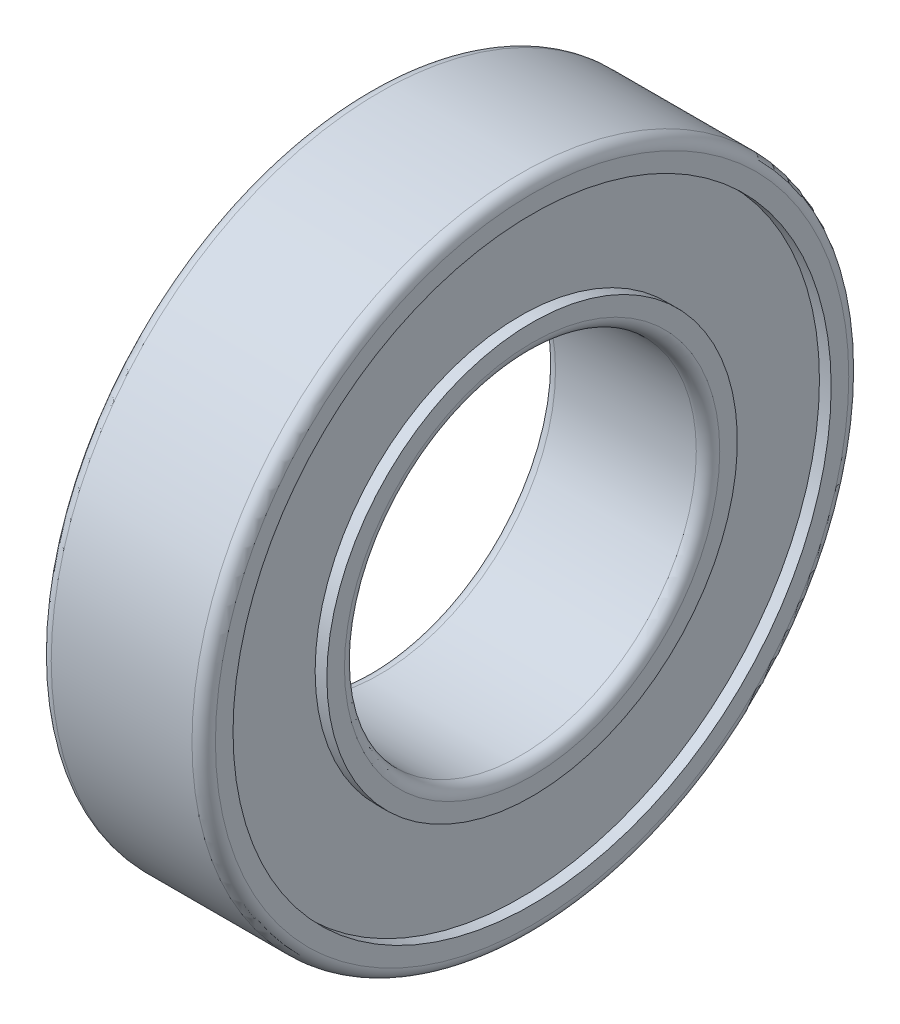
ISO-10303-21;
HEADER;
FILE_DESCRIPTION(('STEP AP214'),'2;1');
FILE_NAME('part.step','',(''),(''),'','','');
FILE_SCHEMA(('AUTOMOTIVE_DESIGN { 1 0 10303 214 1 1 1 1 }'));
ENDSEC;
DATA;
#1=APPLICATION_CONTEXT('core data for automotive mechanical design processes');
#2=APPLICATION_PROTOCOL_DEFINITION('international standard','automotive_design',2000,#1);
#3=PRODUCT_CONTEXT('',#1,'mechanical');
#4=PRODUCT('Part','Part','',(#3));
#5=PRODUCT_RELATED_PRODUCT_CATEGORY('part','',(#4));
#6=PRODUCT_DEFINITION_FORMATION('','',#4);
#7=PRODUCT_DEFINITION_CONTEXT('part definition',#1,'design');
#8=PRODUCT_DEFINITION('design','',#6,#7);
#9=PRODUCT_DEFINITION_SHAPE('','',#8);
#10=(LENGTH_UNIT() NAMED_UNIT(*) SI_UNIT(.MILLI.,.METRE.));
#11=(NAMED_UNIT(*) PLANE_ANGLE_UNIT() SI_UNIT($,.RADIAN.));
#12=(NAMED_UNIT(*) SI_UNIT($,.STERADIAN.) SOLID_ANGLE_UNIT());
#13=UNCERTAINTY_MEASURE_WITH_UNIT(LENGTH_MEASURE(1.E-05),#10,'distance_accuracy_value','');
#14=(GEOMETRIC_REPRESENTATION_CONTEXT(3) GLOBAL_UNCERTAINTY_ASSIGNED_CONTEXT((#13)) GLOBAL_UNIT_ASSIGNED_CONTEXT((#10,
#11,#12)) REPRESENTATION_CONTEXT('',''));
#15=CARTESIAN_POINT('',(0.,0.,0.));
#16=DIRECTION('',(0.,0.,1.));
#17=DIRECTION('',(1.,0.,0.));
#18=AXIS2_PLACEMENT_3D('',#15,#16,#17);
#19=CARTESIAN_POINT('',(0.5,12.75,0.));
#20=DIRECTION('',(1.,0.,0.));
#21=DIRECTION('',(0.,0.,-1.));
#22=AXIS2_PLACEMENT_3D('',#19,#20,#21);
#23=PLANE('',#22);
#24=CARTESIAN_POINT('',(0.5,0.,0.));
#25=DIRECTION('',(-1.,0.,0.));
#26=DIRECTION('',(0.,0.,1.));
#27=AXIS2_PLACEMENT_3D('',#24,#25,#26);
#28=CIRCLE('',#27,12.75);
#29=CARTESIAN_POINT('',(0.5,0.,12.75));
#30=VERTEX_POINT('',#29);
#31=EDGE_CURVE('E297',#30,#30,#28,.T.);
#32=ORIENTED_EDGE('',*,*,#31,.T.);
#33=EDGE_LOOP('',(#32));
#34=FACE_BOUND('',#33,.T.);
#35=CARTESIAN_POINT('',(0.5,0.,0.));
#36=DIRECTION('',(-1.,0.,0.));
#37=DIRECTION('',(0.,0.,1.));
#38=AXIS2_PLACEMENT_3D('',#35,#36,#37);
#39=CIRCLE('',#38,8.75);
#40=CARTESIAN_POINT('',(0.5,0.,8.75));
#41=VERTEX_POINT('',#40);
#42=EDGE_CURVE('E295',#41,#41,#39,.T.);
#43=ORIENTED_EDGE('',*,*,#42,.F.);
#44=EDGE_LOOP('',(#43));
#45=FACE_BOUND('',#44,.T.);
#46=ADVANCED_FACE('F16',(#34,#45),#23,.F.);
#47=CARTESIAN_POINT('',(0.,0.,0.));
#48=DIRECTION('',(-1.,0.,0.));
#49=DIRECTION('',(0.,0.,1.));
#50=AXIS2_PLACEMENT_3D('',#47,#48,#49);
#51=CYLINDRICAL_SURFACE('',#50,12.75);
#52=ORIENTED_EDGE('',*,*,#31,.F.);
#53=EDGE_LOOP('',(#52));
#54=FACE_BOUND('',#53,.T.);
#55=CARTESIAN_POINT('',(0.,0.,0.));
#56=DIRECTION('',(-1.,0.,0.));
#57=DIRECTION('',(0.,0.,1.));
#58=AXIS2_PLACEMENT_3D('',#55,#56,#57);
#59=CIRCLE('',#58,12.75);
#60=CARTESIAN_POINT('',(0.,0.,12.75));
#61=VERTEX_POINT('',#60);
#62=EDGE_CURVE('E292',#61,#61,#59,.T.);
#63=ORIENTED_EDGE('',*,*,#62,.T.);
#64=EDGE_LOOP('',(#63));
#65=FACE_BOUND('',#64,.T.);
#66=ADVANCED_FACE('F101',(#54,#65),#51,.F.);
#67=CARTESIAN_POINT('',(0.,0.,0.));
#68=DIRECTION('',(-1.,0.,0.));
#69=DIRECTION('',(0.,0.,1.));
#70=AXIS2_PLACEMENT_3D('',#67,#68,#69);
#71=CYLINDRICAL_SURFACE('',#70,8.75);
#72=CARTESIAN_POINT('',(0.,0.,0.));
#73=DIRECTION('',(-1.,0.,0.));
#74=DIRECTION('',(0.,0.,1.));
#75=AXIS2_PLACEMENT_3D('',#72,#73,#74);
#76=CIRCLE('',#75,8.75);
#77=CARTESIAN_POINT('',(0.,0.,8.75));
#78=VERTEX_POINT('',#77);
#79=EDGE_CURVE('E69',#78,#78,#76,.F.);
#80=ORIENTED_EDGE('',*,*,#79,.T.);
#81=EDGE_LOOP('',(#80));
#82=FACE_BOUND('',#81,.T.);
#83=ORIENTED_EDGE('',*,*,#42,.T.);
#84=EDGE_LOOP('',(#83));
#85=FACE_BOUND('',#84,.T.);
#86=ADVANCED_FACE('F89',(#82,#85),#71,.T.);
#87=CARTESIAN_POINT('',(0.,14.,0.));
#88=DIRECTION('',(1.,0.,0.));
#89=DIRECTION('',(0.,0.,-1.));
#90=AXIS2_PLACEMENT_3D('',#87,#88,#89);
#91=PLANE('',#90);
#92=ORIENTED_EDGE('',*,*,#62,.F.);
#93=EDGE_LOOP('',(#92));
#94=FACE_BOUND('',#93,.T.);
#95=CARTESIAN_POINT('',(0.,0.,0.));
#96=DIRECTION('',(1.,0.,0.));
#97=DIRECTION('',(0.,0.,-1.));
#98=AXIS2_PLACEMENT_3D('',#95,#96,#97);
#99=CIRCLE('',#98,13.5);
#100=CARTESIAN_POINT('',(0.,0.,-13.5));
#101=VERTEX_POINT('',#100);
#102=CARTESIAN_POINT('',(0.,0.,13.5));
#103=VERTEX_POINT('',#102);
#104=EDGE_CURVE('E56',#101,#103,#99,.T.);
#105=ORIENTED_EDGE('',*,*,#104,.F.);
#106=CARTESIAN_POINT('',(0.,0.,0.));
#107=DIRECTION('',(1.,0.,0.));
#108=DIRECTION('',(0.,0.,1.));
#109=AXIS2_PLACEMENT_3D('',#106,#107,#108);
#110=CIRCLE('',#109,13.5);
#111=EDGE_CURVE('E58',#103,#101,#110,.T.);
#112=ORIENTED_EDGE('',*,*,#111,.F.);
#113=EDGE_LOOP('',(#105,#112));
#114=FACE_BOUND('',#113,.T.);
#115=ADVANCED_FACE('F68',(#94,#114),#91,.F.);
#116=CARTESIAN_POINT('',(0.,8.75,0.));
#117=DIRECTION('',(1.,0.,0.));
#118=DIRECTION('',(0.,0.,-1.));
#119=AXIS2_PLACEMENT_3D('',#116,#117,#118);
#120=PLANE('',#119);
#121=ORIENTED_EDGE('',*,*,#79,.F.);
#122=EDGE_LOOP('',(#121));
#123=FACE_BOUND('',#122,.T.);
#124=CARTESIAN_POINT('',(0.,0.,0.));
#125=DIRECTION('',(-1.,0.,0.));
#126=DIRECTION('',(0.,0.,-1.));
#127=AXIS2_PLACEMENT_3D('',#124,#125,#126);
#128=CIRCLE('',#127,8.);
#129=CARTESIAN_POINT('',(0.,0.,-8.));
#130=VERTEX_POINT('',#129);
#131=CARTESIAN_POINT('',(0.,0.,8.));
#132=VERTEX_POINT('',#131);
#133=EDGE_CURVE('E64',#130,#132,#128,.T.);
#134=ORIENTED_EDGE('',*,*,#133,.F.);
#135=CARTESIAN_POINT('',(0.,0.,0.));
#136=DIRECTION('',(-1.,0.,0.));
#137=DIRECTION('',(0.,0.,1.));
#138=AXIS2_PLACEMENT_3D('',#135,#136,#137);
#139=CIRCLE('',#138,8.);
#140=EDGE_CURVE('E239',#132,#130,#139,.T.);
#141=ORIENTED_EDGE('',*,*,#140,.F.);
#142=EDGE_LOOP('',(#134,#141));
#143=FACE_BOUND('',#142,.T.);
#144=ADVANCED_FACE('F88',(#123,#143),#120,.F.);
#145=CARTESIAN_POINT('',(0.500000000000002,0.,0.));
#146=DIRECTION('',(1.,0.,0.));
#147=DIRECTION('',(0.,0.,-1.));
#148=AXIS2_PLACEMENT_3D('',#145,#146,#147);
#149=TOROIDAL_SURFACE('',#148,13.5,0.5);
#150=ORIENTED_EDGE('',*,*,#104,.T.);
#151=ORIENTED_EDGE('',*,*,#111,.T.);
#152=EDGE_LOOP('',(#150,#151));
#153=FACE_BOUND('',#152,.T.);
#154=CARTESIAN_POINT('',(0.500000000000002,0.,0.));
#155=DIRECTION('',(-1.,0.,0.));
#156=DIRECTION('',(0.,0.,1.));
#157=AXIS2_PLACEMENT_3D('',#154,#155,#156);
#158=CIRCLE('',#157,14.);
#159=CARTESIAN_POINT('',(0.500000000000002,0.,14.));
#160=VERTEX_POINT('',#159);
#161=EDGE_CURVE('E236',#160,#160,#158,.F.);
#162=ORIENTED_EDGE('',*,*,#161,.F.);
#163=EDGE_LOOP('',(#162));
#164=FACE_BOUND('',#163,.T.);
#165=ADVANCED_FACE('F60',(#153,#164),#149,.T.);
#166=CARTESIAN_POINT('',(0.5,0.,0.));
#167=DIRECTION('',(1.,0.,0.));
#168=DIRECTION('',(0.,0.,-1.));
#169=AXIS2_PLACEMENT_3D('',#166,#167,#168);
#170=TOROIDAL_SURFACE('',#169,8.,0.5);
#171=ORIENTED_EDGE('',*,*,#133,.T.);
#172=ORIENTED_EDGE('',*,*,#140,.T.);
#173=EDGE_LOOP('',(#171,#172));
#174=FACE_BOUND('',#173,.T.);
#175=CARTESIAN_POINT('',(0.5,0.,0.));
#176=DIRECTION('',(-1.,0.,0.));
#177=DIRECTION('',(0.,0.,1.));
#178=AXIS2_PLACEMENT_3D('',#175,#176,#177);
#179=CIRCLE('',#178,7.5);
#180=CARTESIAN_POINT('',(0.5,0.,7.5));
#181=VERTEX_POINT('',#180);
#182=EDGE_CURVE('E232',#181,#181,#179,.F.);
#183=ORIENTED_EDGE('',*,*,#182,.T.);
#184=EDGE_LOOP('',(#183));
#185=FACE_BOUND('',#184,.T.);
#186=ADVANCED_FACE('F216',(#174,#185),#170,.T.);
#187=CARTESIAN_POINT('',(0.,0.,0.));
#188=DIRECTION('',(-1.,0.,0.));
#189=DIRECTION('',(0.,0.,1.));
#190=AXIS2_PLACEMENT_3D('',#187,#188,#189);
#191=CYLINDRICAL_SURFACE('',#190,14.);
#192=CARTESIAN_POINT('',(6.5,0.,0.));
#193=DIRECTION('',(-1.,0.,0.));
#194=DIRECTION('',(0.,0.,1.));
#195=AXIS2_PLACEMENT_3D('',#192,#193,#194);
#196=CIRCLE('',#195,14.);
#197=CARTESIAN_POINT('',(6.5,0.,14.));
#198=VERTEX_POINT('',#197);
#199=EDGE_CURVE('E262',#198,#198,#196,.F.);
#200=ORIENTED_EDGE('',*,*,#199,.F.);
#201=EDGE_LOOP('',(#200));
#202=FACE_BOUND('',#201,.T.);
#203=ORIENTED_EDGE('',*,*,#161,.T.);
#204=EDGE_LOOP('',(#203));
#205=FACE_BOUND('',#204,.T.);
#206=ADVANCED_FACE('F226',(#202,#205),#191,.T.);
#207=CARTESIAN_POINT('',(0.,0.,0.));
#208=DIRECTION('',(-1.,0.,0.));
#209=DIRECTION('',(0.,0.,1.));
#210=AXIS2_PLACEMENT_3D('',#207,#208,#209);
#211=CYLINDRICAL_SURFACE('',#210,7.5);
#212=CARTESIAN_POINT('',(6.5,0.,0.));
#213=DIRECTION('',(-1.,0.,0.));
#214=DIRECTION('',(0.,0.,1.));
#215=AXIS2_PLACEMENT_3D('',#212,#213,#214);
#216=CIRCLE('',#215,7.5);
#217=CARTESIAN_POINT('',(6.5,0.,7.5));
#218=VERTEX_POINT('',#217);
#219=EDGE_CURVE('E264',#218,#218,#216,.T.);
#220=ORIENTED_EDGE('',*,*,#219,.F.);
#221=EDGE_LOOP('',(#220));
#222=FACE_BOUND('',#221,.T.);
#223=ORIENTED_EDGE('',*,*,#182,.F.);
#224=EDGE_LOOP('',(#223));
#225=FACE_BOUND('',#224,.T.);
#226=ADVANCED_FACE('F323',(#222,#225),#211,.F.);
#227=CARTESIAN_POINT('',(6.5,0.,0.));
#228=DIRECTION('',(-1.,0.,0.));
#229=DIRECTION('',(0.,0.,1.));
#230=AXIS2_PLACEMENT_3D('',#227,#228,#229);
#231=TOROIDAL_SURFACE('',#230,13.5,0.5);
#232=CARTESIAN_POINT('',(7.,0.,0.));
#233=DIRECTION('',(-1.,0.,0.));
#234=DIRECTION('',(0.,0.,1.));
#235=AXIS2_PLACEMENT_3D('',#232,#233,#234);
#236=CIRCLE('',#235,13.5);
#237=CARTESIAN_POINT('',(7.,0.,13.5));
#238=VERTEX_POINT('',#237);
#239=CARTESIAN_POINT('',(7.,0.,-13.5));
#240=VERTEX_POINT('',#239);
#241=EDGE_CURVE('E154',#238,#240,#236,.T.);
#242=ORIENTED_EDGE('',*,*,#241,.T.);
#243=CARTESIAN_POINT('',(7.,0.,0.));
#244=DIRECTION('',(-1.,0.,0.));
#245=DIRECTION('',(0.,0.,-1.));
#246=AXIS2_PLACEMENT_3D('',#243,#244,#245);
#247=CIRCLE('',#246,13.5);
#248=EDGE_CURVE('E165',#240,#238,#247,.T.);
#249=ORIENTED_EDGE('',*,*,#248,.T.);
#250=EDGE_LOOP('',(#242,#249));
#251=FACE_BOUND('',#250,.T.);
#252=ORIENTED_EDGE('',*,*,#199,.T.);
#253=EDGE_LOOP('',(#252));
#254=FACE_BOUND('',#253,.T.);
#255=ADVANCED_FACE('F181',(#251,#254),#231,.T.);
#256=CARTESIAN_POINT('',(6.5,0.,0.));
#257=DIRECTION('',(-1.,0.,0.));
#258=DIRECTION('',(0.,0.,1.));
#259=AXIS2_PLACEMENT_3D('',#256,#257,#258);
#260=TOROIDAL_SURFACE('',#259,8.,0.5);
#261=CARTESIAN_POINT('',(7.,0.,0.));
#262=DIRECTION('',(1.,0.,0.));
#263=DIRECTION('',(0.,0.,1.));
#264=AXIS2_PLACEMENT_3D('',#261,#262,#263);
#265=CIRCLE('',#264,8.);
#266=CARTESIAN_POINT('',(7.,0.,8.));
#267=VERTEX_POINT('',#266);
#268=CARTESIAN_POINT('',(7.,0.,-8.));
#269=VERTEX_POINT('',#268);
#270=EDGE_CURVE('E279',#267,#269,#265,.T.);
#271=ORIENTED_EDGE('',*,*,#270,.T.);
#272=CARTESIAN_POINT('',(7.,0.,0.));
#273=DIRECTION('',(1.,0.,0.));
#274=DIRECTION('',(0.,0.,-1.));
#275=AXIS2_PLACEMENT_3D('',#272,#273,#274);
#276=CIRCLE('',#275,8.);
#277=EDGE_CURVE('E35',#269,#267,#276,.T.);
#278=ORIENTED_EDGE('',*,*,#277,.T.);
#279=EDGE_LOOP('',(#271,#278));
#280=FACE_BOUND('',#279,.T.);
#281=ORIENTED_EDGE('',*,*,#219,.T.);
#282=EDGE_LOOP('',(#281));
#283=FACE_BOUND('',#282,.T.);
#284=ADVANCED_FACE('F177',(#280,#283),#260,.T.);
#285=CARTESIAN_POINT('',(7.,12.75,0.));
#286=DIRECTION('',(-1.,0.,0.));
#287=DIRECTION('',(0.,0.,1.));
#288=AXIS2_PLACEMENT_3D('',#285,#286,#287);
#289=PLANE('',#288);
#290=CARTESIAN_POINT('',(7.,0.,0.));
#291=DIRECTION('',(-1.,0.,0.));
#292=DIRECTION('',(0.,0.,1.));
#293=AXIS2_PLACEMENT_3D('',#290,#291,#292);
#294=CIRCLE('',#293,12.75);
#295=CARTESIAN_POINT('',(7.,0.,12.75));
#296=VERTEX_POINT('',#295);
#297=EDGE_CURVE('E280',#296,#296,#294,.T.);
#298=ORIENTED_EDGE('',*,*,#297,.T.);
#299=EDGE_LOOP('',(#298));
#300=FACE_BOUND('',#299,.T.);
#301=ORIENTED_EDGE('',*,*,#241,.F.);
#302=ORIENTED_EDGE('',*,*,#248,.F.);
#303=EDGE_LOOP('',(#301,#302));
#304=FACE_BOUND('',#303,.T.);
#305=ADVANCED_FACE('F133',(#300,#304),#289,.F.);
#306=CARTESIAN_POINT('',(7.,7.5,0.));
#307=DIRECTION('',(-1.,0.,0.));
#308=DIRECTION('',(0.,0.,1.));
#309=AXIS2_PLACEMENT_3D('',#306,#307,#308);
#310=PLANE('',#309);
#311=CARTESIAN_POINT('',(7.,0.,0.));
#312=DIRECTION('',(-1.,0.,0.));
#313=DIRECTION('',(0.,0.,1.));
#314=AXIS2_PLACEMENT_3D('',#311,#312,#313);
#315=CIRCLE('',#314,8.75);
#316=CARTESIAN_POINT('',(7.,0.,8.75));
#317=VERTEX_POINT('',#316);
#318=EDGE_CURVE('E282',#317,#317,#315,.T.);
#319=ORIENTED_EDGE('',*,*,#318,.F.);
#320=EDGE_LOOP('',(#319));
#321=FACE_BOUND('',#320,.T.);
#322=ORIENTED_EDGE('',*,*,#270,.F.);
#323=ORIENTED_EDGE('',*,*,#277,.F.);
#324=EDGE_LOOP('',(#322,#323));
#325=FACE_BOUND('',#324,.T.);
#326=ADVANCED_FACE('F128',(#321,#325),#310,.F.);
#327=CARTESIAN_POINT('',(0.,0.,0.));
#328=DIRECTION('',(-1.,0.,0.));
#329=DIRECTION('',(0.,0.,1.));
#330=AXIS2_PLACEMENT_3D('',#327,#328,#329);
#331=CYLINDRICAL_SURFACE('',#330,12.75);
#332=ORIENTED_EDGE('',*,*,#297,.F.);
#333=EDGE_LOOP('',(#332));
#334=FACE_BOUND('',#333,.T.);
#335=CARTESIAN_POINT('',(6.5,0.,0.));
#336=DIRECTION('',(-1.,0.,0.));
#337=DIRECTION('',(0.,0.,1.));
#338=AXIS2_PLACEMENT_3D('',#335,#336,#337);
#339=CIRCLE('',#338,12.75);
#340=CARTESIAN_POINT('',(6.5,0.,12.75));
#341=VERTEX_POINT('',#340);
#342=EDGE_CURVE('E27',#341,#341,#339,.T.);
#343=ORIENTED_EDGE('',*,*,#342,.T.);
#344=EDGE_LOOP('',(#343));
#345=FACE_BOUND('',#344,.T.);
#346=ADVANCED_FACE('F120',(#334,#345),#331,.F.);
#347=CARTESIAN_POINT('',(0.,0.,0.));
#348=DIRECTION('',(-1.,0.,0.));
#349=DIRECTION('',(0.,0.,1.));
#350=AXIS2_PLACEMENT_3D('',#347,#348,#349);
#351=CYLINDRICAL_SURFACE('',#350,8.75);
#352=CARTESIAN_POINT('',(6.5,0.,0.));
#353=DIRECTION('',(-1.,0.,0.));
#354=DIRECTION('',(0.,0.,1.));
#355=AXIS2_PLACEMENT_3D('',#352,#353,#354);
#356=CIRCLE('',#355,8.75);
#357=CARTESIAN_POINT('',(6.5,0.,8.75));
#358=VERTEX_POINT('',#357);
#359=EDGE_CURVE('E10',#358,#358,#356,.F.);
#360=ORIENTED_EDGE('',*,*,#359,.T.);
#361=EDGE_LOOP('',(#360));
#362=FACE_BOUND('',#361,.T.);
#363=ORIENTED_EDGE('',*,*,#318,.T.);
#364=EDGE_LOOP('',(#363));
#365=FACE_BOUND('',#364,.T.);
#366=ADVANCED_FACE('F114',(#362,#365),#351,.T.);
#367=CARTESIAN_POINT('',(6.5,8.75,0.));
#368=DIRECTION('',(-1.,0.,0.));
#369=DIRECTION('',(0.,0.,1.));
#370=AXIS2_PLACEMENT_3D('',#367,#368,#369);
#371=PLANE('',#370);
#372=ORIENTED_EDGE('',*,*,#359,.F.);
#373=EDGE_LOOP('',(#372));
#374=FACE_BOUND('',#373,.T.);
#375=ORIENTED_EDGE('',*,*,#342,.F.);
#376=EDGE_LOOP('',(#375));
#377=FACE_BOUND('',#376,.T.);
#378=ADVANCED_FACE('F112',(#374,#377),#371,.F.);
#379=CLOSED_SHELL('',(#46,#66,#86,#115,#144,#165,#186,#206,#226,#255,#284,#305,#326,#346,#366,#378));
#380=MANIFOLD_SOLID_BREP('B1',#379);
#381=ADVANCED_BREP_SHAPE_REPRESENTATION('',(#18,#380),#14);
#382=SHAPE_DEFINITION_REPRESENTATION(#9,#381);
ENDSEC;
END-ISO-10303-21;
